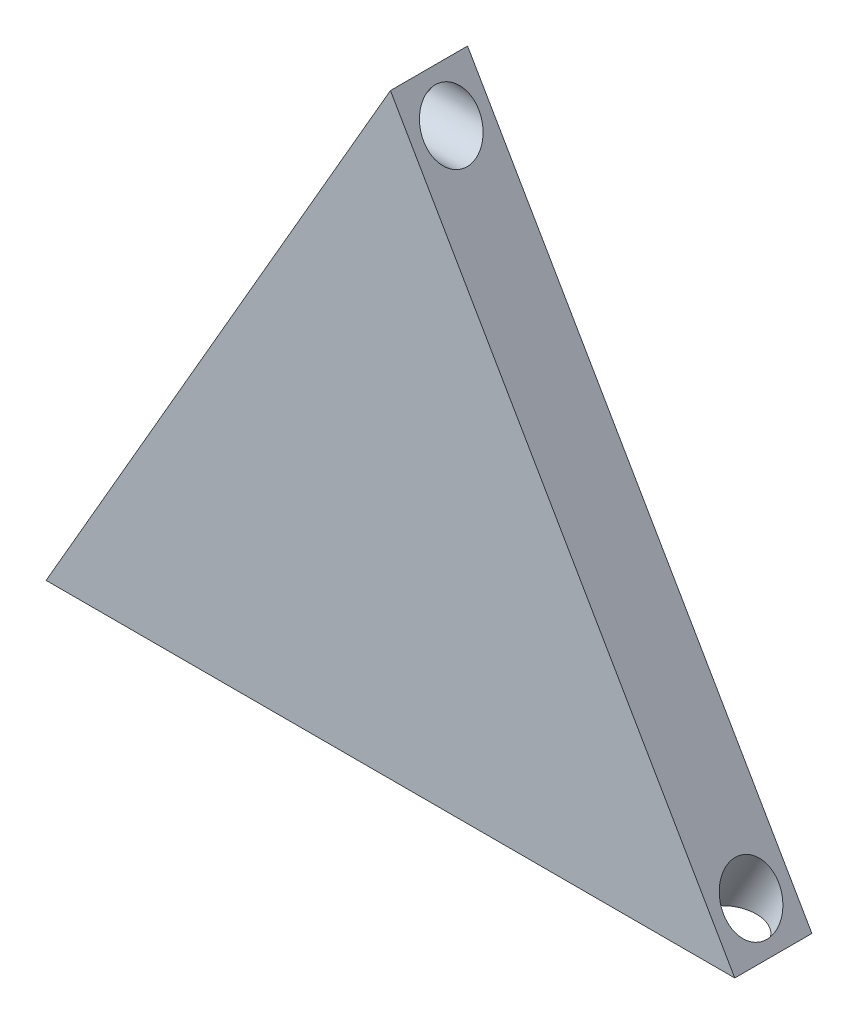
ISO-10303-21;
HEADER;
FILE_DESCRIPTION(('STEP AP214'),'2;1');
FILE_NAME('part.step','',(''),(''),'','','');
FILE_SCHEMA(('AUTOMOTIVE_DESIGN { 1 0 10303 214 1 1 1 1 }'));
ENDSEC;
DATA;
#1=APPLICATION_CONTEXT('core data for automotive mechanical design processes');
#2=APPLICATION_PROTOCOL_DEFINITION('international standard','automotive_design',2000,#1);
#3=PRODUCT_CONTEXT('',#1,'mechanical');
#4=PRODUCT('Part','Part','',(#3));
#5=PRODUCT_RELATED_PRODUCT_CATEGORY('part','',(#4));
#6=PRODUCT_DEFINITION_FORMATION('','',#4);
#7=PRODUCT_DEFINITION_CONTEXT('part definition',#1,'design');
#8=PRODUCT_DEFINITION('design','',#6,#7);
#9=PRODUCT_DEFINITION_SHAPE('','',#8);
#10=(LENGTH_UNIT() NAMED_UNIT(*) SI_UNIT(.MILLI.,.METRE.));
#11=(NAMED_UNIT(*) PLANE_ANGLE_UNIT() SI_UNIT($,.RADIAN.));
#12=(NAMED_UNIT(*) SI_UNIT($,.STERADIAN.) SOLID_ANGLE_UNIT());
#13=UNCERTAINTY_MEASURE_WITH_UNIT(LENGTH_MEASURE(1.E-05),#10,'distance_accuracy_value','');
#14=(GEOMETRIC_REPRESENTATION_CONTEXT(3) GLOBAL_UNCERTAINTY_ASSIGNED_CONTEXT((#13)) GLOBAL_UNIT_ASSIGNED_CONTEXT((#10,
#11,#12)) REPRESENTATION_CONTEXT('',''));
#15=CARTESIAN_POINT('',(0.,0.,0.));
#16=DIRECTION('',(0.,0.,1.));
#17=DIRECTION('',(1.,0.,0.));
#18=AXIS2_PLACEMENT_3D('',#15,#16,#17);
#19=CARTESIAN_POINT('',(19.6428571428571,108.253175473055,14.));
#20=DIRECTION('',(0.866025403784439,-0.5,0.));
#21=DIRECTION('',(0.5,0.866025403784439,0.));
#22=AXIS2_PLACEMENT_3D('',#19,#20,#21);
#23=PLANE('',#22);
#24=CARTESIAN_POINT('',(-38.8156909728155,6.99999999999999,7.));
#25=DIRECTION('',(0.866025403784439,-0.5,0.));
#26=DIRECTION('',(0.5,0.866025403784439,0.));
#27=AXIS2_PLACEMENT_3D('',#24,#25,#26);
#28=ELLIPSE('',#27,5.77350269189625,5.);
#29=CARTESIAN_POINT('',(-35.9289396268674,12.,7.));
#30=VERTEX_POINT('',#29);
#31=EDGE_CURVE('E105',#30,#30,#28,.F.);
#32=ORIENTED_EDGE('',*,*,#31,.F.);
#33=EDGE_LOOP('',(#32));
#34=FACE_BOUND('',#33,.T.);
#35=CARTESIAN_POINT('',(15.6014052585297,101.253175473055,7.));
#36=DIRECTION('',(0.866025403784439,-0.5,0.));
#37=DIRECTION('',(-0.5,-0.866025403784439,0.));
#38=AXIS2_PLACEMENT_3D('',#35,#36,#37);
#39=ELLIPSE('',#38,5.77350269189626,5.);
#40=CARTESIAN_POINT('',(12.7146539125816,96.2531754730548,7.));
#41=VERTEX_POINT('',#40);
#42=EDGE_CURVE('E93',#41,#41,#39,.F.);
#43=ORIENTED_EDGE('',*,*,#42,.F.);
#44=EDGE_LOOP('',(#43));
#45=FACE_BOUND('',#44,.T.);
#46=DIRECTION('',(-0.5,-0.866025403784439,0.));
#47=VECTOR('',#46,1.);
#48=CARTESIAN_POINT('',(19.6428571428571,108.253175473055,0.));
#49=LINE('',#48,#47);
#50=CARTESIAN_POINT('',(19.6428571428571,108.253175473055,0.));
#51=VERTEX_POINT('',#50);
#52=CARTESIAN_POINT('',(-42.8571428571429,0.,0.));
#53=VERTEX_POINT('',#52);
#54=EDGE_CURVE('E90',#51,#53,#49,.T.);
#55=ORIENTED_EDGE('',*,*,#54,.T.);
#56=DIRECTION('',(0.,0.,-1.));
#57=VECTOR('',#56,1.);
#58=CARTESIAN_POINT('',(-42.8571428571429,0.,14.));
#59=LINE('',#58,#57);
#60=CARTESIAN_POINT('',(-42.8571428571429,0.,14.));
#61=VERTEX_POINT('',#60);
#62=EDGE_CURVE('E11',#61,#53,#59,.T.);
#63=ORIENTED_EDGE('',*,*,#62,.F.);
#64=DIRECTION('',(-0.5,-0.866025403784439,0.));
#65=VECTOR('',#64,1.);
#66=CARTESIAN_POINT('',(19.6428571428571,108.253175473055,14.));
#67=LINE('',#66,#65);
#68=CARTESIAN_POINT('',(19.6428571428571,108.253175473055,14.));
#69=VERTEX_POINT('',#68);
#70=EDGE_CURVE('E83',#69,#61,#67,.T.);
#71=ORIENTED_EDGE('',*,*,#70,.F.);
#72=DIRECTION('',(0.,0.,-1.));
#73=VECTOR('',#72,1.);
#74=CARTESIAN_POINT('',(19.6428571428571,108.253175473055,14.));
#75=LINE('',#74,#73);
#76=EDGE_CURVE('E91',#69,#51,#75,.T.);
#77=ORIENTED_EDGE('',*,*,#76,.T.);
#78=EDGE_LOOP('',(#55,#63,#71,#77));
#79=FACE_BOUND('',#78,.T.);
#80=ADVANCED_FACE('F41',(#34,#45,#79),#23,.F.);
#81=CARTESIAN_POINT('',(-42.8571428571429,0.,14.));
#82=DIRECTION('',(0.,1.,0.));
#83=DIRECTION('',(0.,0.,1.));
#84=AXIS2_PLACEMENT_3D('',#81,#82,#83);
#85=PLANE('',#84);
#86=CARTESIAN_POINT('',(74.0599533742024,0.,7.));
#87=DIRECTION('',(0.,1.,0.));
#88=DIRECTION('',(-1.,0.,0.));
#89=AXIS2_PLACEMENT_3D('',#86,#87,#88);
#90=ELLIPSE('',#89,5.77350269189626,5.);
#91=CARTESIAN_POINT('',(68.2864506823061,0.,7.));
#92=VERTEX_POINT('',#91);
#93=EDGE_CURVE('E108',#92,#92,#90,.F.);
#94=ORIENTED_EDGE('',*,*,#93,.F.);
#95=EDGE_LOOP('',(#94));
#96=FACE_BOUND('',#95,.T.);
#97=CARTESIAN_POINT('',(-34.7742390884881,0.,7.));
#98=DIRECTION('',(0.,1.,0.));
#99=DIRECTION('',(-1.,0.,0.));
#100=AXIS2_PLACEMENT_3D('',#97,#98,#99);
#101=ELLIPSE('',#100,5.77350269189625,5.);
#102=CARTESIAN_POINT('',(-40.5477417803844,0.,7.));
#103=VERTEX_POINT('',#102);
#104=EDGE_CURVE('E106',#103,#103,#101,.F.);
#105=ORIENTED_EDGE('',*,*,#104,.F.);
#106=EDGE_LOOP('',(#105));
#107=FACE_BOUND('',#106,.T.);
#108=DIRECTION('',(1.,0.,0.));
#109=VECTOR('',#108,1.);
#110=CARTESIAN_POINT('',(-42.8571428571429,0.,0.));
#111=LINE('',#110,#109);
#112=CARTESIAN_POINT('',(82.1428571428571,0.,0.));
#113=VERTEX_POINT('',#112);
#114=EDGE_CURVE('E71',#53,#113,#111,.T.);
#115=ORIENTED_EDGE('',*,*,#114,.T.);
#116=DIRECTION('',(0.,0.,-1.));
#117=VECTOR('',#116,1.);
#118=CARTESIAN_POINT('',(82.1428571428571,0.,14.));
#119=LINE('',#118,#117);
#120=CARTESIAN_POINT('',(82.1428571428571,0.,14.));
#121=VERTEX_POINT('',#120);
#122=EDGE_CURVE('E50',#121,#113,#119,.T.);
#123=ORIENTED_EDGE('',*,*,#122,.F.);
#124=DIRECTION('',(1.,0.,0.));
#125=VECTOR('',#124,1.);
#126=CARTESIAN_POINT('',(-42.8571428571429,0.,14.));
#127=LINE('',#126,#125);
#128=EDGE_CURVE('E79',#61,#121,#127,.T.);
#129=ORIENTED_EDGE('',*,*,#128,.F.);
#130=ORIENTED_EDGE('',*,*,#62,.T.);
#131=EDGE_LOOP('',(#115,#123,#129,#130));
#132=FACE_BOUND('',#131,.T.);
#133=ADVANCED_FACE('F80',(#96,#107,#132),#85,.F.);
#134=CARTESIAN_POINT('',(82.1428571428571,0.,14.));
#135=DIRECTION('',(-0.866025403784439,-0.5,0.));
#136=DIRECTION('',(0.5,-0.866025403784439,0.));
#137=AXIS2_PLACEMENT_3D('',#134,#135,#136);
#138=PLANE('',#137);
#139=CARTESIAN_POINT('',(78.1014052585297,6.99999999999999,7.));
#140=DIRECTION('',(-0.866025403784439,-0.5,0.));
#141=DIRECTION('',(0.5,-0.866025403784439,0.));
#142=AXIS2_PLACEMENT_3D('',#139,#140,#141);
#143=ELLIPSE('',#142,5.77350269189625,5.);
#144=CARTESIAN_POINT('',(80.9881566044779,1.99999999999999,7.));
#145=VERTEX_POINT('',#144);
#146=EDGE_CURVE('E44',#145,#145,#143,.F.);
#147=ORIENTED_EDGE('',*,*,#146,.F.);
#148=EDGE_LOOP('',(#147));
#149=FACE_BOUND('',#148,.T.);
#150=CARTESIAN_POINT('',(23.6843090271845,101.253175473055,7.));
#151=DIRECTION('',(-0.866025403784439,-0.5,0.));
#152=DIRECTION('',(-0.5,0.866025403784439,0.));
#153=AXIS2_PLACEMENT_3D('',#150,#151,#152);
#154=ELLIPSE('',#153,5.77350269189626,5.);
#155=CARTESIAN_POINT('',(20.7975576812364,106.253175473055,7.));
#156=VERTEX_POINT('',#155);
#157=EDGE_CURVE('E97',#156,#156,#154,.F.);
#158=ORIENTED_EDGE('',*,*,#157,.F.);
#159=EDGE_LOOP('',(#158));
#160=FACE_BOUND('',#159,.T.);
#161=DIRECTION('',(-0.5,0.866025403784439,0.));
#162=VECTOR('',#161,1.);
#163=CARTESIAN_POINT('',(82.1428571428571,0.,0.));
#164=LINE('',#163,#162);
#165=EDGE_CURVE('E76',#113,#51,#164,.T.);
#166=ORIENTED_EDGE('',*,*,#165,.T.);
#167=ORIENTED_EDGE('',*,*,#76,.F.);
#168=DIRECTION('',(-0.5,0.866025403784439,0.));
#169=VECTOR('',#168,1.);
#170=CARTESIAN_POINT('',(82.1428571428571,0.,14.));
#171=LINE('',#170,#169);
#172=EDGE_CURVE('E59',#121,#69,#171,.T.);
#173=ORIENTED_EDGE('',*,*,#172,.F.);
#174=ORIENTED_EDGE('',*,*,#122,.T.);
#175=EDGE_LOOP('',(#166,#167,#173,#174));
#176=FACE_BOUND('',#175,.T.);
#177=ADVANCED_FACE('F122',(#149,#160,#176),#138,.F.);
#178=CARTESIAN_POINT('',(0.,0.,14.));
#179=DIRECTION('',(0.,0.,1.));
#180=DIRECTION('',(1.,0.,0.));
#181=AXIS2_PLACEMENT_3D('',#178,#179,#180);
#182=PLANE('',#181);
#183=ORIENTED_EDGE('',*,*,#70,.T.);
#184=ORIENTED_EDGE('',*,*,#128,.T.);
#185=ORIENTED_EDGE('',*,*,#172,.T.);
#186=EDGE_LOOP('',(#183,#184,#185));
#187=FACE_BOUND('',#186,.T.);
#188=ADVANCED_FACE('F86',(#187),#182,.T.);
#189=CARTESIAN_POINT('',(0.,0.,0.));
#190=DIRECTION('',(0.,0.,1.));
#191=DIRECTION('',(1.,0.,0.));
#192=AXIS2_PLACEMENT_3D('',#189,#190,#191);
#193=PLANE('',#192);
#194=ORIENTED_EDGE('',*,*,#54,.F.);
#195=ORIENTED_EDGE('',*,*,#165,.F.);
#196=ORIENTED_EDGE('',*,*,#114,.F.);
#197=EDGE_LOOP('',(#194,#195,#196));
#198=FACE_BOUND('',#197,.T.);
#199=ADVANCED_FACE('F132',(#198),#193,.F.);
#200=CARTESIAN_POINT('',(50.,101.253175473055,7.));
#201=DIRECTION('',(-1.,0.,0.));
#202=DIRECTION('',(0.,0.,1.));
#203=AXIS2_PLACEMENT_3D('',#200,#201,#202);
#204=CYLINDRICAL_SURFACE('',#203,5.);
#205=ORIENTED_EDGE('',*,*,#157,.T.);
#206=EDGE_LOOP('',(#205));
#207=FACE_BOUND('',#206,.T.);
#208=ORIENTED_EDGE('',*,*,#42,.T.);
#209=EDGE_LOOP('',(#208));
#210=FACE_BOUND('',#209,.T.);
#211=ADVANCED_FACE('F128',(#207,#210),#204,.F.);
#212=CARTESIAN_POINT('',(-11.7949650306518,-39.8012701892219,7.));
#213=DIRECTION('',(-0.5,0.866025403784438,0.));
#214=DIRECTION('',(-0.866025403784438,-0.5,0.));
#215=AXIS2_PLACEMENT_3D('',#212,#213,#214);
#216=CYLINDRICAL_SURFACE('',#215,5.);
#217=ORIENTED_EDGE('',*,*,#104,.T.);
#218=EDGE_LOOP('',(#217));
#219=FACE_BOUND('',#218,.T.);
#220=ORIENTED_EDGE('',*,*,#31,.T.);
#221=EDGE_LOOP('',(#220));
#222=FACE_BOUND('',#221,.T.);
#223=ADVANCED_FACE('F131',(#219,#222),#216,.F.);
#224=CARTESIAN_POINT('',(101.080679316366,46.8012701892219,7.));
#225=DIRECTION('',(-0.5,-0.866025403784438,0.));
#226=DIRECTION('',(0.866025403784438,-0.5,0.));
#227=AXIS2_PLACEMENT_3D('',#224,#225,#226);
#228=CYLINDRICAL_SURFACE('',#227,5.);
#229=ORIENTED_EDGE('',*,*,#146,.T.);
#230=EDGE_LOOP('',(#229));
#231=FACE_BOUND('',#230,.T.);
#232=ORIENTED_EDGE('',*,*,#93,.T.);
#233=EDGE_LOOP('',(#232));
#234=FACE_BOUND('',#233,.T.);
#235=ADVANCED_FACE('F120',(#231,#234),#228,.F.);
#236=CLOSED_SHELL('',(#80,#133,#177,#188,#199,#211,#223,#235));
#237=MANIFOLD_SOLID_BREP('B2',#236);
#238=ADVANCED_BREP_SHAPE_REPRESENTATION('',(#18,#237),#14);
#239=SHAPE_DEFINITION_REPRESENTATION(#9,#238);
ENDSEC;
END-ISO-10303-21;
